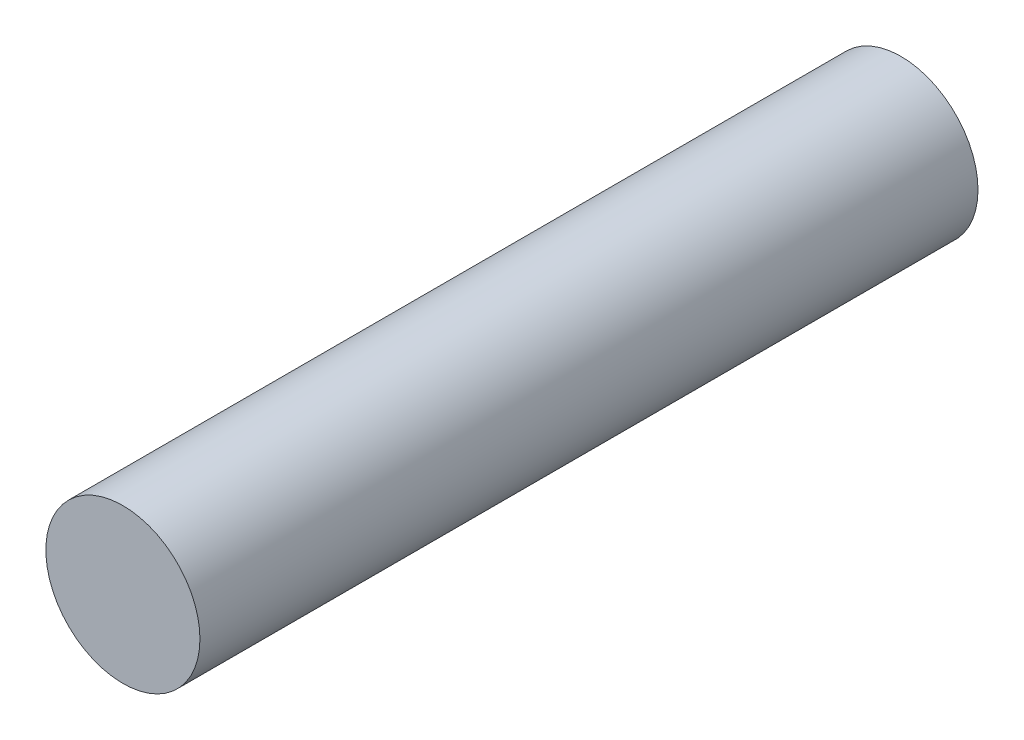
ISO-10303-21;
HEADER;
FILE_DESCRIPTION(('STEP AP214'),'2;1');
FILE_NAME('part.step','',(''),(''),'','','');
FILE_SCHEMA(('AUTOMOTIVE_DESIGN { 1 0 10303 214 1 1 1 1 }'));
ENDSEC;
DATA;
#1=APPLICATION_CONTEXT('core data for automotive mechanical design processes');
#2=APPLICATION_PROTOCOL_DEFINITION('international standard','automotive_design',2000,#1);
#3=PRODUCT_CONTEXT('',#1,'mechanical');
#4=PRODUCT('Part','Part','',(#3));
#5=PRODUCT_RELATED_PRODUCT_CATEGORY('part','',(#4));
#6=PRODUCT_DEFINITION_FORMATION('','',#4);
#7=PRODUCT_DEFINITION_CONTEXT('part definition',#1,'design');
#8=PRODUCT_DEFINITION('design','',#6,#7);
#9=PRODUCT_DEFINITION_SHAPE('','',#8);
#10=(LENGTH_UNIT() NAMED_UNIT(*) SI_UNIT(.MILLI.,.METRE.));
#11=(NAMED_UNIT(*) PLANE_ANGLE_UNIT() SI_UNIT($,.RADIAN.));
#12=(NAMED_UNIT(*) SI_UNIT($,.STERADIAN.) SOLID_ANGLE_UNIT());
#13=UNCERTAINTY_MEASURE_WITH_UNIT(LENGTH_MEASURE(1.E-05),#10,'distance_accuracy_value','');
#14=(GEOMETRIC_REPRESENTATION_CONTEXT(3) GLOBAL_UNCERTAINTY_ASSIGNED_CONTEXT((#13)) GLOBAL_UNIT_ASSIGNED_CONTEXT((#10,
#11,#12)) REPRESENTATION_CONTEXT('',''));
#15=CARTESIAN_POINT('',(0.,0.,0.));
#16=DIRECTION('',(0.,0.,1.));
#17=DIRECTION('',(1.,0.,0.));
#18=AXIS2_PLACEMENT_3D('',#15,#16,#17);
#19=CARTESIAN_POINT('',(0.,0.,25.65));
#20=DIRECTION('',(0.,0.,-1.));
#21=DIRECTION('',(-1.,0.,0.));
#22=AXIS2_PLACEMENT_3D('',#19,#20,#21);
#23=CYLINDRICAL_SURFACE('',#22,2.54);
#24=CARTESIAN_POINT('',(0.,0.,25.65));
#25=DIRECTION('',(0.,0.,1.));
#26=DIRECTION('',(1.,0.,0.));
#27=AXIS2_PLACEMENT_3D('',#24,#25,#26);
#28=CIRCLE('',#27,2.54);
#29=CARTESIAN_POINT('',(2.54,0.,25.65));
#30=VERTEX_POINT('',#29);
#31=EDGE_CURVE('E10',#30,#30,#28,.T.);
#32=ORIENTED_EDGE('',*,*,#31,.F.);
#33=EDGE_LOOP('',(#32));
#34=FACE_BOUND('',#33,.T.);
#35=CARTESIAN_POINT('',(0.,0.,0.));
#36=DIRECTION('',(0.,0.,1.));
#37=DIRECTION('',(1.,0.,0.));
#38=AXIS2_PLACEMENT_3D('',#35,#36,#37);
#39=CIRCLE('',#38,2.54);
#40=CARTESIAN_POINT('',(2.54,0.,0.));
#41=VERTEX_POINT('',#40);
#42=EDGE_CURVE('E40',#41,#41,#39,.T.);
#43=ORIENTED_EDGE('',*,*,#42,.T.);
#44=EDGE_LOOP('',(#43));
#45=FACE_BOUND('',#44,.T.);
#46=ADVANCED_FACE('F37',(#34,#45),#23,.T.);
#47=CARTESIAN_POINT('',(0.,0.,25.65));
#48=DIRECTION('',(0.,0.,1.));
#49=DIRECTION('',(1.,0.,0.));
#50=AXIS2_PLACEMENT_3D('',#47,#48,#49);
#51=PLANE('',#50);
#52=ORIENTED_EDGE('',*,*,#31,.T.);
#53=EDGE_LOOP('',(#52));
#54=FACE_BOUND('',#53,.T.);
#55=ADVANCED_FACE('F54',(#54),#51,.T.);
#56=CARTESIAN_POINT('',(0.,0.,0.));
#57=DIRECTION('',(0.,0.,1.));
#58=DIRECTION('',(1.,0.,0.));
#59=AXIS2_PLACEMENT_3D('',#56,#57,#58);
#60=PLANE('',#59);
#61=ORIENTED_EDGE('',*,*,#42,.F.);
#62=EDGE_LOOP('',(#61));
#63=FACE_BOUND('',#62,.T.);
#64=ADVANCED_FACE('F52',(#63),#60,.F.);
#65=CLOSED_SHELL('',(#46,#55,#64));
#66=MANIFOLD_SOLID_BREP('B2',#65);
#67=ADVANCED_BREP_SHAPE_REPRESENTATION('',(#18,#66),#14);
#68=SHAPE_DEFINITION_REPRESENTATION(#9,#67);
ENDSEC;
END-ISO-10303-21;
